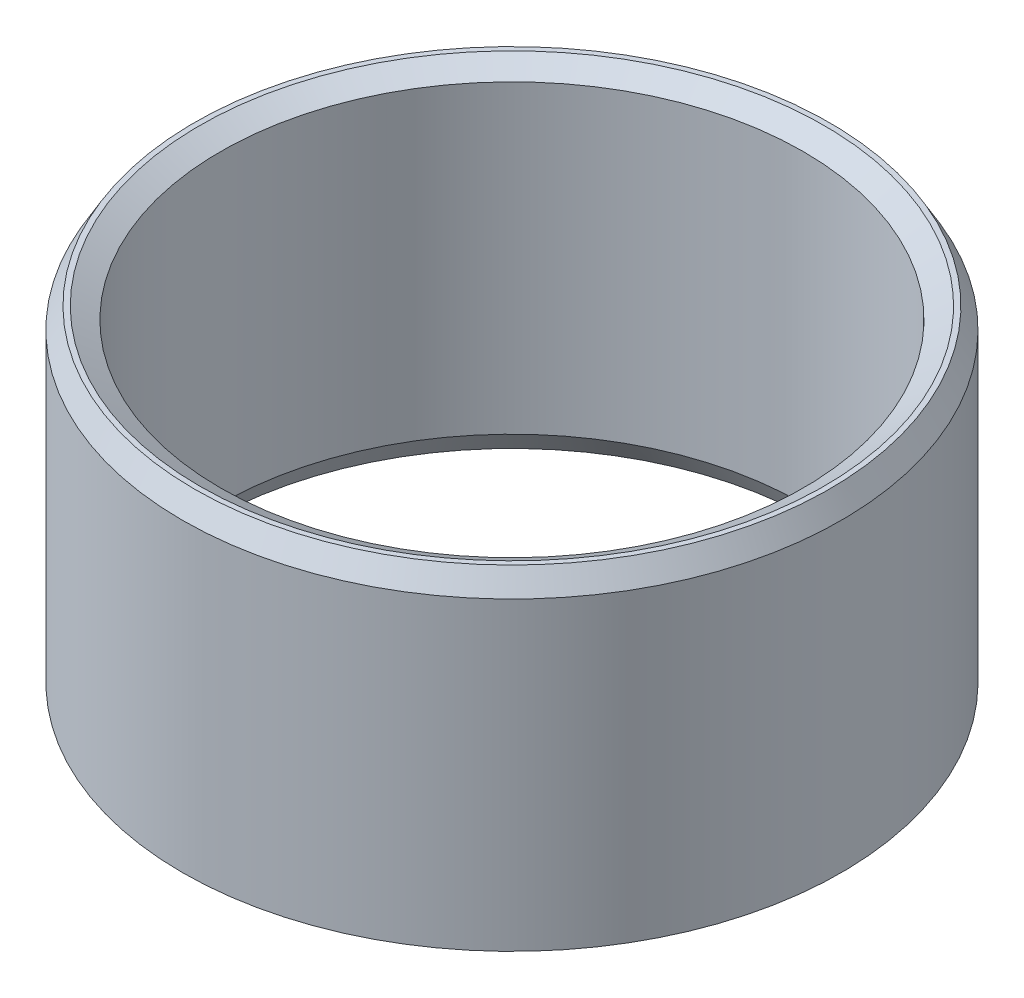
ISO-10303-21;
HEADER;
FILE_DESCRIPTION(('STEP AP214'),'2;1');
FILE_NAME('part.step','',(''),(''),'','','');
FILE_SCHEMA(('AUTOMOTIVE_DESIGN { 1 0 10303 214 1 1 1 1 }'));
ENDSEC;
DATA;
#1=APPLICATION_CONTEXT('core data for automotive mechanical design processes');
#2=APPLICATION_PROTOCOL_DEFINITION('international standard','automotive_design',2000,#1);
#3=PRODUCT_CONTEXT('',#1,'mechanical');
#4=PRODUCT('Part','Part','',(#3));
#5=PRODUCT_RELATED_PRODUCT_CATEGORY('part','',(#4));
#6=PRODUCT_DEFINITION_FORMATION('','',#4);
#7=PRODUCT_DEFINITION_CONTEXT('part definition',#1,'design');
#8=PRODUCT_DEFINITION('design','',#6,#7);
#9=PRODUCT_DEFINITION_SHAPE('','',#8);
#10=(LENGTH_UNIT() NAMED_UNIT(*) SI_UNIT(.MILLI.,.METRE.));
#11=(NAMED_UNIT(*) PLANE_ANGLE_UNIT() SI_UNIT($,.RADIAN.));
#12=(NAMED_UNIT(*) SI_UNIT($,.STERADIAN.) SOLID_ANGLE_UNIT());
#13=UNCERTAINTY_MEASURE_WITH_UNIT(LENGTH_MEASURE(1.E-05),#10,'distance_accuracy_value','');
#14=(GEOMETRIC_REPRESENTATION_CONTEXT(3) GLOBAL_UNCERTAINTY_ASSIGNED_CONTEXT((#13)) GLOBAL_UNIT_ASSIGNED_CONTEXT((#10,
#11,#12)) REPRESENTATION_CONTEXT('',''));
#15=CARTESIAN_POINT('',(0.,0.,0.));
#16=DIRECTION('',(0.,0.,1.));
#17=DIRECTION('',(1.,0.,0.));
#18=AXIS2_PLACEMENT_3D('',#15,#16,#17);
#19=CARTESIAN_POINT('',(0.,38.4734633329982,0.));
#20=DIRECTION('',(0.,-1.,0.));
#21=DIRECTION('',(0.,0.,-1.));
#22=AXIS2_PLACEMENT_3D('',#19,#20,#21);
#23=CYLINDRICAL_SURFACE('',#22,37.5);
#24=CARTESIAN_POINT('',(0.,1.37404949459217,0.));
#25=DIRECTION('',(0.,1.,0.));
#26=DIRECTION('',(0.,0.,1.));
#27=AXIS2_PLACEMENT_3D('',#24,#25,#26);
#28=CIRCLE('',#27,37.5);
#29=CARTESIAN_POINT('',(0.,1.37404949459217,37.5));
#30=VERTEX_POINT('',#29);
#31=EDGE_CURVE('E10',#30,#30,#28,.T.);
#32=ORIENTED_EDGE('',*,*,#31,.T.);
#33=EDGE_LOOP('',(#32));
#34=FACE_BOUND('',#33,.T.);
#35=CARTESIAN_POINT('',(0.,36.0935397962501,0.));
#36=DIRECTION('',(0.,1.,0.));
#37=DIRECTION('',(0.,0.,1.));
#38=AXIS2_PLACEMENT_3D('',#35,#36,#37);
#39=CIRCLE('',#38,37.5);
#40=CARTESIAN_POINT('',(0.,36.0935397962501,37.5));
#41=VERTEX_POINT('',#40);
#42=EDGE_CURVE('E50',#41,#41,#39,.F.);
#43=ORIENTED_EDGE('',*,*,#42,.T.);
#44=EDGE_LOOP('',(#43));
#45=FACE_BOUND('',#44,.T.);
#46=ADVANCED_FACE('F39',(#34,#45),#23,.T.);
#47=CARTESIAN_POINT('',(0.,38.4734633329982,0.));
#48=DIRECTION('',(0.,1.,0.));
#49=DIRECTION('',(0.,0.,1.));
#50=AXIS2_PLACEMENT_3D('',#47,#48,#49);
#51=PLANE('',#50);
#52=CARTESIAN_POINT('',(0.,38.4734633329982,0.));
#53=DIRECTION('',(0.,1.,0.));
#54=DIRECTION('',(0.,0.,1.));
#55=AXIS2_PLACEMENT_3D('',#52,#53,#54);
#56=CIRCLE('',#55,35.5358156946033);
#57=CARTESIAN_POINT('',(0.,38.4734633329982,35.5358156946033));
#58=VERTEX_POINT('',#57);
#59=EDGE_CURVE('E58',#58,#58,#56,.F.);
#60=ORIENTED_EDGE('',*,*,#59,.T.);
#61=EDGE_LOOP('',(#60));
#62=FACE_BOUND('',#61,.T.);
#63=CARTESIAN_POINT('',(0.,38.4734633329982,0.));
#64=DIRECTION('',(0.,1.,0.));
#65=DIRECTION('',(0.,0.,1.));
#66=AXIS2_PLACEMENT_3D('',#63,#64,#65);
#67=CIRCLE('',#66,36.1259505054078);
#68=CARTESIAN_POINT('',(0.,38.4734633329982,36.1259505054078));
#69=VERTEX_POINT('',#68);
#70=EDGE_CURVE('E61',#69,#69,#67,.T.);
#71=ORIENTED_EDGE('',*,*,#70,.T.);
#72=EDGE_LOOP('',(#71));
#73=FACE_BOUND('',#72,.T.);
#74=ADVANCED_FACE('F88',(#62,#73),#51,.T.);
#75=CARTESIAN_POINT('',(0.,0.,0.));
#76=DIRECTION('',(0.,1.,0.));
#77=DIRECTION('',(0.,0.,1.));
#78=AXIS2_PLACEMENT_3D('',#75,#76,#77);
#79=PLANE('',#78);
#80=CARTESIAN_POINT('',(0.,0.,0.));
#81=DIRECTION('',(0.,1.,0.));
#82=DIRECTION('',(0.,0.,1.));
#83=AXIS2_PLACEMENT_3D('',#80,#81,#82);
#84=CIRCLE('',#83,34.5299416524475);
#85=CARTESIAN_POINT('',(0.,0.,34.5299416524475));
#86=VERTEX_POINT('',#85);
#87=EDGE_CURVE('E51',#86,#86,#84,.T.);
#88=ORIENTED_EDGE('',*,*,#87,.T.);
#89=EDGE_LOOP('',(#88));
#90=FACE_BOUND('',#89,.T.);
#91=CARTESIAN_POINT('',(0.,0.,0.));
#92=DIRECTION('',(0.,1.,0.));
#93=DIRECTION('',(0.,0.,1.));
#94=AXIS2_PLACEMENT_3D('',#91,#92,#93);
#95=CIRCLE('',#94,35.120076463252);
#96=CARTESIAN_POINT('',(0.,0.,35.120076463252));
#97=VERTEX_POINT('',#96);
#98=EDGE_CURVE('E54',#97,#97,#95,.F.);
#99=ORIENTED_EDGE('',*,*,#98,.T.);
#100=EDGE_LOOP('',(#99));
#101=FACE_BOUND('',#100,.T.);
#102=ADVANCED_FACE('F83',(#90,#101),#79,.F.);
#103=CARTESIAN_POINT('',(0.,38.4734633329982,0.));
#104=DIRECTION('',(0.,-1.,0.));
#105=DIRECTION('',(0.,0.,-1.));
#106=AXIS2_PLACEMENT_3D('',#103,#104,#105);
#107=CYLINDRICAL_SURFACE('',#106,33.1558921578553);
#108=CARTESIAN_POINT('',(0.,37.099413838406,0.));
#109=DIRECTION('',(0.,1.,0.));
#110=DIRECTION('',(0.,0.,1.));
#111=AXIS2_PLACEMENT_3D('',#108,#109,#110);
#112=CIRCLE('',#111,33.1558921578553);
#113=CARTESIAN_POINT('',(0.,37.099413838406,33.1558921578553));
#114=VERTEX_POINT('',#113);
#115=EDGE_CURVE('E67',#114,#114,#112,.T.);
#116=ORIENTED_EDGE('',*,*,#115,.T.);
#117=EDGE_LOOP('',(#116));
#118=FACE_BOUND('',#117,.T.);
#119=CARTESIAN_POINT('',(0.,2.37992353674801,0.));
#120=DIRECTION('',(0.,1.,0.));
#121=DIRECTION('',(0.,0.,1.));
#122=AXIS2_PLACEMENT_3D('',#119,#120,#121);
#123=CIRCLE('',#122,33.1558921578553);
#124=CARTESIAN_POINT('',(0.,2.37992353674801,33.1558921578553));
#125=VERTEX_POINT('',#124);
#126=EDGE_CURVE('E69',#125,#125,#123,.F.);
#127=ORIENTED_EDGE('',*,*,#126,.T.);
#128=EDGE_LOOP('',(#127));
#129=FACE_BOUND('',#128,.T.);
#130=ADVANCED_FACE('F71',(#118,#129),#107,.F.);
#131=CARTESIAN_POINT('',(0.,37.099413838406,0.));
#132=DIRECTION('',(0.,1.,0.));
#133=DIRECTION('',(0.,0.,1.));
#134=AXIS2_PLACEMENT_3D('',#131,#132,#133);
#135=CONICAL_SURFACE('',#134,33.1558921578553,1.0471975511966);
#136=CARTESIAN_POINT('',(0.,38.4734633329982,35.5358156946033));
#137=CARTESIAN_POINT('',(0.,38.4591503174295,35.5110248244288));
#138=CARTESIAN_POINT('',(0.,38.4448373018608,35.4862339542544));
#139=CARTESIAN_POINT('',(0.,38.4162112707235,35.4366522139055));
#140=CARTESIAN_POINT('',(0.,38.4018982551548,35.411861343731));
#141=CARTESIAN_POINT('',(0.,38.3732722240175,35.3622796033821));
#142=CARTESIAN_POINT('',(0.,38.3589592084488,35.3374887332076));
#143=CARTESIAN_POINT('',(0.,38.3303331773115,35.2879069928587));
#144=CARTESIAN_POINT('',(0.,38.3160201617428,35.2631161226843));
#145=CARTESIAN_POINT('',(0.,38.2873941306055,35.2135343823353));
#146=CARTESIAN_POINT('',(0.,38.2730811150368,35.1887435121609));
#147=CARTESIAN_POINT('',(0.,38.2444550838995,35.139161771812));
#148=CARTESIAN_POINT('',(0.,38.2301420683308,35.1143709016375));
#149=CARTESIAN_POINT('',(0.,38.2015160371934,35.0647891612886));
#150=CARTESIAN_POINT('',(0.,38.1872030216248,35.0399982911141));
#151=CARTESIAN_POINT('',(0.,38.1585769904874,34.9904165507652));
#152=CARTESIAN_POINT('',(0.,38.1442639749188,34.9656256805908));
#153=CARTESIAN_POINT('',(0.,38.1156379437814,34.9160439402418));
#154=CARTESIAN_POINT('',(0.,38.1013249282128,34.8912530700674));
#155=CARTESIAN_POINT('',(0.,38.0726988970754,34.8416713297185));
#156=CARTESIAN_POINT('',(0.,38.0583858815068,34.816880459544));
#157=CARTESIAN_POINT('',(0.,38.0297598503694,34.7672987191951));
#158=CARTESIAN_POINT('',(0.,38.0154468348008,34.7425078490206));
#159=CARTESIAN_POINT('',(0.,37.9868208036634,34.6929261086717));
#160=CARTESIAN_POINT('',(0.,37.9725077880948,34.6681352384973));
#161=CARTESIAN_POINT('',(0.,37.9438817569574,34.6185534981484));
#162=CARTESIAN_POINT('',(0.,37.9295687413887,34.5937626279739));
#163=CARTESIAN_POINT('',(0.,37.9009427102514,34.544180887625));
#164=CARTESIAN_POINT('',(0.,37.8866296946827,34.5193900174505));
#165=CARTESIAN_POINT('',(0.,37.8580036635454,34.4698082771016));
#166=CARTESIAN_POINT('',(0.,37.8436906479767,34.4450174069271));
#167=CARTESIAN_POINT('',(0.,37.8150646168394,34.3954356665782));
#168=CARTESIAN_POINT('',(0.,37.8007516012707,34.3706447964038));
#169=CARTESIAN_POINT('',(0.,37.7721255701334,34.3210630560549));
#170=CARTESIAN_POINT('',(0.,37.7578125545647,34.2962721858804));
#171=CARTESIAN_POINT('',(0.,37.7291865234274,34.2466904455315));
#172=CARTESIAN_POINT('',(0.,37.7148735078587,34.221899575357));
#173=CARTESIAN_POINT('',(0.,37.6862474767214,34.1723178350081));
#174=CARTESIAN_POINT('',(0.,37.6719344611527,34.1475269648336));
#175=CARTESIAN_POINT('',(0.,37.6433084300154,34.0979452244847));
#176=CARTESIAN_POINT('',(0.,37.6289954144467,34.0731543543103));
#177=CARTESIAN_POINT('',(0.,37.6003693833094,34.0235726139614));
#178=CARTESIAN_POINT('',(0.,37.5860563677407,33.9987817437869));
#179=CARTESIAN_POINT('',(0.,37.5574303366034,33.949200003438));
#180=CARTESIAN_POINT('',(0.,37.5431173210347,33.9244091332635));
#181=CARTESIAN_POINT('',(0.,37.5144912898974,33.8748273929146));
#182=CARTESIAN_POINT('',(0.,37.5001782743287,33.8500365227401));
#183=CARTESIAN_POINT('',(0.,37.4715522431914,33.8004547823912));
#184=CARTESIAN_POINT('',(0.,37.4572392276227,33.7756639122168));
#185=CARTESIAN_POINT('',(0.,37.4286131964854,33.7260821718679));
#186=CARTESIAN_POINT('',(0.,37.4143001809167,33.7012913016934));
#187=CARTESIAN_POINT('',(0.,37.3856741497793,33.6517095613445));
#188=CARTESIAN_POINT('',(0.,37.3713611342107,33.62691869117));
#189=CARTESIAN_POINT('',(0.,37.3427351030733,33.5773369508211));
#190=CARTESIAN_POINT('',(0.,37.3284220875047,33.5525460806466));
#191=CARTESIAN_POINT('',(0.,37.2997960563673,33.5029643402977));
#192=CARTESIAN_POINT('',(0.,37.2854830407987,33.4781734701233));
#193=CARTESIAN_POINT('',(0.,37.2568570096613,33.4285917297744));
#194=CARTESIAN_POINT('',(0.,37.2425439940927,33.4038008595999));
#195=CARTESIAN_POINT('',(0.,37.2139179629553,33.354219119251));
#196=CARTESIAN_POINT('',(0.,37.1996049473867,33.3294282490765));
#197=CARTESIAN_POINT('',(0.,37.1709789162493,33.2798465087276));
#198=CARTESIAN_POINT('',(0.,37.1566659006806,33.2550556385532));
#199=CARTESIAN_POINT('',(0.,37.1280398695433,33.2054738982042));
#200=CARTESIAN_POINT('',(0.,37.1137268539746,33.1806830280298));
#201=CARTESIAN_POINT('',(0.,37.099413838406,33.1558921578553));
#202=B_SPLINE_CURVE_WITH_KNOTS('',3,(#136,#137,#138,#139,#140,#141,#142,#143,#144,#145,#146,
#147,#148,#149,#150,#151,#152,#153,#154,#155,#156,#157,#158,#159,#160,#161,#162,#163,#164,#165,
#166,#167,#168,#169,#170,#171,#172,#173,#174,#175,#176,#177,#178,#179,#180,#181,#182,#183,#184,
#185,#186,#187,#188,#189,#190,#191,#192,#193,#194,#195,#196,#197,#198,#199,#200,#201),
.UNSPECIFIED.,.F.,.F.,(4,2,2,2,2,2,2,2,2,2,2,2,2,2,2,2,2,2,2,2,2,2,2,2,2,2,2,2,2,2,2,2,4),(0.,
0.0858780934120082,0.171756186824022,0.257634280236031,0.343512373648045,0.429390467060053,
0.515268560472061,0.601146653884075,0.687024747296083,0.772902840708098,0.858780934120106,
0.944659027532116,1.03053712094412,1.11641521435614,1.20229330776815,1.28817140118015,
1.37404949459217,1.45992758800418,1.54580568141619,1.6316837748282,1.71756186824021,
1.80343996165222,1.88931805506423,1.97519614847624,2.06107424188825,2.14695233530026,
2.23283042871227,2.31870852212429,2.40458661553629,2.49046470894831,2.57634280236032,
2.66222089577233,2.74809898918434),.UNSPECIFIED.);
#203=EDGE_CURVE('BSEAM77',#58,#114,#202,.T.);
#204=ORIENTED_EDGE('',*,*,#59,.F.);
#205=ORIENTED_EDGE('',*,*,#115,.F.);
#206=ORIENTED_EDGE('',*,*,#203,.T.);
#207=ORIENTED_EDGE('',*,*,#203,.F.);
#208=EDGE_LOOP('',(#204,#206,#205,#207));
#209=FACE_BOUND('',#208,.T.);
#210=ADVANCED_FACE('F77',(#209),#135,.F.);
#211=CARTESIAN_POINT('',(0.,0.,0.));
#212=DIRECTION('',(0.,-1.,0.));
#213=DIRECTION('',(0.,0.,-1.));
#214=AXIS2_PLACEMENT_3D('',#211,#212,#213);
#215=CONICAL_SURFACE('',#214,34.5299416524475,0.523598775598294);
#216=ORIENTED_EDGE('',*,*,#126,.F.);
#217=EDGE_LOOP('',(#216));
#218=FACE_BOUND('',#217,.T.);
#219=ORIENTED_EDGE('',*,*,#87,.F.);
#220=EDGE_LOOP('',(#219));
#221=FACE_BOUND('',#220,.T.);
#222=ADVANCED_FACE('F73',(#218,#221),#215,.F.);
#223=CARTESIAN_POINT('',(0.,1.37404949459217,0.));
#224=DIRECTION('',(0.,1.,0.));
#225=DIRECTION('',(0.,0.,1.));
#226=AXIS2_PLACEMENT_3D('',#223,#224,#225);
#227=CONICAL_SURFACE('',#226,37.5,1.0471975511966);
#228=CARTESIAN_POINT('',(0.,0.,35.120076463252));
#229=CARTESIAN_POINT('',(0.,0.0143130155686699,35.1448673334265));
#230=CARTESIAN_POINT('',(0.,0.0286260311373377,35.1696582036009));
#231=CARTESIAN_POINT('',(0.,0.0572520622746734,35.2192399439499));
#232=CARTESIAN_POINT('',(0.,0.0715650778433412,35.2440308141243));
#233=CARTESIAN_POINT('',(0.,0.100191108980678,35.2936125544732));
#234=CARTESIAN_POINT('',(0.,0.114504124549348,35.3184034246477));
#235=CARTESIAN_POINT('',(0.,0.143130155686684,35.3679851649966));
#236=CARTESIAN_POINT('',(0.,0.157443171255352,35.3927760351711));
#237=CARTESIAN_POINT('',(0.,0.186069202392689,35.44235777552));
#238=CARTESIAN_POINT('',(0.,0.200382217961358,35.4671486456944));
#239=CARTESIAN_POINT('',(0.,0.229008249098695,35.5167303860433));
#240=CARTESIAN_POINT('',(0.,0.243321264667362,35.5415212562178));
#241=CARTESIAN_POINT('',(0.,0.271947295804699,35.5911029965667));
#242=CARTESIAN_POINT('',(0.,0.286260311373369,35.6158938667412));
#243=CARTESIAN_POINT('',(0.,0.314886342510706,35.6654756070901));
#244=CARTESIAN_POINT('',(0.,0.329199358079373,35.6902664772646));
#245=CARTESIAN_POINT('',(0.,0.35782538921671,35.7398482176135));
#246=CARTESIAN_POINT('',(0.,0.372138404785379,35.7646390877879));
#247=CARTESIAN_POINT('',(0.,0.400764435922716,35.8142208281368));
#248=CARTESIAN_POINT('',(0.,0.415077451491383,35.8390116983113));
#249=CARTESIAN_POINT('',(0.,0.44370348262872,35.8885934386602));
#250=CARTESIAN_POINT('',(0.,0.45801649819739,35.9133843088347));
#251=CARTESIAN_POINT('',(0.,0.486642529334727,35.9629660491836));
#252=CARTESIAN_POINT('',(0.,0.500955544903394,35.9877569193581));
#253=CARTESIAN_POINT('',(0.,0.529581576040731,36.037338659707));
#254=CARTESIAN_POINT('',(0.,0.5438945916094,36.0621295298814));
#255=CARTESIAN_POINT('',(0.,0.572520622746737,36.1117112702303));
#256=CARTESIAN_POINT('',(0.,0.586833638315404,36.1365021404048));
#257=CARTESIAN_POINT('',(0.,0.615459669452741,36.1860838807537));
#258=CARTESIAN_POINT('',(0.,0.629772685021411,36.2108747509282));
#259=CARTESIAN_POINT('',(0.,0.658398716158748,36.2604564912771));
#260=CARTESIAN_POINT('',(0.,0.672711731727415,36.2852473614516));
#261=CARTESIAN_POINT('',(0.,0.701337762864752,36.3348291018005));
#262=CARTESIAN_POINT('',(0.,0.715650778433421,36.3596199719749));
#263=CARTESIAN_POINT('',(0.,0.744276809570758,36.4092017123238));
#264=CARTESIAN_POINT('',(0.,0.758589825139426,36.4339925824983));
#265=CARTESIAN_POINT('',(0.,0.787215856276762,36.4835743228472));
#266=CARTESIAN_POINT('',(0.,0.801528871845432,36.5083651930217));
#267=CARTESIAN_POINT('',(0.,0.830154902982769,36.5579469333706));
#268=CARTESIAN_POINT('',(0.,0.844467918551436,36.5827378035451));
#269=CARTESIAN_POINT('',(0.,0.873093949688773,36.632319543894));
#270=CARTESIAN_POINT('',(0.,0.887406965257442,36.6571104140684));
#271=CARTESIAN_POINT('',(0.,0.916032996394779,36.7066921544173));
#272=CARTESIAN_POINT('',(0.,0.930346011963447,36.7314830245918));
#273=CARTESIAN_POINT('',(0.,0.958972043100783,36.7810647649407));
#274=CARTESIAN_POINT('',(0.,0.973285058669453,36.8058556351152));
#275=CARTESIAN_POINT('',(0.,1.00191108980679,36.8554373754641));
#276=CARTESIAN_POINT('',(0.,1.01622410537546,36.8802282456386));
#277=CARTESIAN_POINT('',(0.,1.04485013651279,36.9298099859875));
#278=CARTESIAN_POINT('',(0.,1.05916315208146,36.9546008561619));
#279=CARTESIAN_POINT('',(0.,1.0877891832188,37.0041825965108));
#280=CARTESIAN_POINT('',(0.,1.10210219878747,37.0289734666853));
#281=CARTESIAN_POINT('',(0.,1.1307282299248,37.0785552070342));
#282=CARTESIAN_POINT('',(0.,1.14504124549347,37.1033460772087));
#283=CARTESIAN_POINT('',(0.,1.17366727663081,37.1529278175576));
#284=CARTESIAN_POINT('',(0.,1.18798029219948,37.1777186877321));
#285=CARTESIAN_POINT('',(0.,1.21660632333682,37.227300428081));
#286=CARTESIAN_POINT('',(0.,1.23091933890548,37.2520912982554));
#287=CARTESIAN_POINT('',(0.,1.25954537004282,37.3016730386043));
#288=CARTESIAN_POINT('',(0.,1.27385838561149,37.3264639087788));
#289=CARTESIAN_POINT('',(0.,1.30248441674883,37.3760456491277));
#290=CARTESIAN_POINT('',(0.,1.31679743231749,37.4008365193022));
#291=CARTESIAN_POINT('',(0.,1.34542346345483,37.4504182596511));
#292=CARTESIAN_POINT('',(0.,1.3597364790235,37.4752091298256));
#293=CARTESIAN_POINT('',(0.,1.37404949459217,37.5));
#294=B_SPLINE_CURVE_WITH_KNOTS('',3,(#228,#229,#230,#231,#232,#233,#234,#235,#236,#237,#238,
#239,#240,#241,#242,#243,#244,#245,#246,#247,#248,#249,#250,#251,#252,#253,#254,#255,#256,#257,
#258,#259,#260,#261,#262,#263,#264,#265,#266,#267,#268,#269,#270,#271,#272,#273,#274,#275,#276,
#277,#278,#279,#280,#281,#282,#283,#284,#285,#286,#287,#288,#289,#290,#291,#292,#293),
.UNSPECIFIED.,.F.,.F.,(4,2,2,2,2,2,2,2,2,2,2,2,2,2,2,2,2,2,2,2,2,2,2,2,2,2,2,2,2,2,2,2,4),(0.,
0.0858780934120079,0.171756186824022,0.25763428023603,0.343512373648043,0.429390467060051,
0.515268560472065,0.601146653884073,0.687024747296087,0.772902840708095,0.858780934120108,
0.944659027532116,1.03053712094413,1.11641521435614,1.20229330776815,1.28817140118016,
1.37404949459217,1.45992758800418,1.5458056814162,1.6316837748282,1.71756186824022,
1.80343996165223,1.88931805506424,1.97519614847625,2.06107424188826,2.14695233530027,
2.23283042871228,2.3187085221243,2.40458661553631,2.49046470894831,2.57634280236033,
2.66222089577234,2.74809898918435),.UNSPECIFIED.);
#295=EDGE_CURVE('BSEAM76',#97,#30,#294,.T.);
#296=ORIENTED_EDGE('',*,*,#98,.F.);
#297=ORIENTED_EDGE('',*,*,#31,.F.);
#298=ORIENTED_EDGE('',*,*,#295,.T.);
#299=ORIENTED_EDGE('',*,*,#295,.F.);
#300=EDGE_LOOP('',(#296,#298,#297,#299));
#301=FACE_BOUND('',#300,.T.);
#302=ADVANCED_FACE('F76',(#301),#227,.T.);
#303=CARTESIAN_POINT('',(0.,38.4734633329982,0.));
#304=DIRECTION('',(0.,-1.,0.));
#305=DIRECTION('',(0.,0.,-1.));
#306=AXIS2_PLACEMENT_3D('',#303,#304,#305);
#307=CONICAL_SURFACE('',#306,36.1259505054078,0.523598775598296);
#308=ORIENTED_EDGE('',*,*,#42,.F.);
#309=EDGE_LOOP('',(#308));
#310=FACE_BOUND('',#309,.T.);
#311=ORIENTED_EDGE('',*,*,#70,.F.);
#312=EDGE_LOOP('',(#311));
#313=FACE_BOUND('',#312,.T.);
#314=ADVANCED_FACE('F45',(#310,#313),#307,.T.);
#315=CLOSED_SHELL('',(#46,#74,#102,#130,#210,#222,#302,#314));
#316=MANIFOLD_SOLID_BREP('B2',#315);
#317=ADVANCED_BREP_SHAPE_REPRESENTATION('',(#18,#316),#14);
#318=SHAPE_DEFINITION_REPRESENTATION(#9,#317);
ENDSEC;
END-ISO-10303-21;
